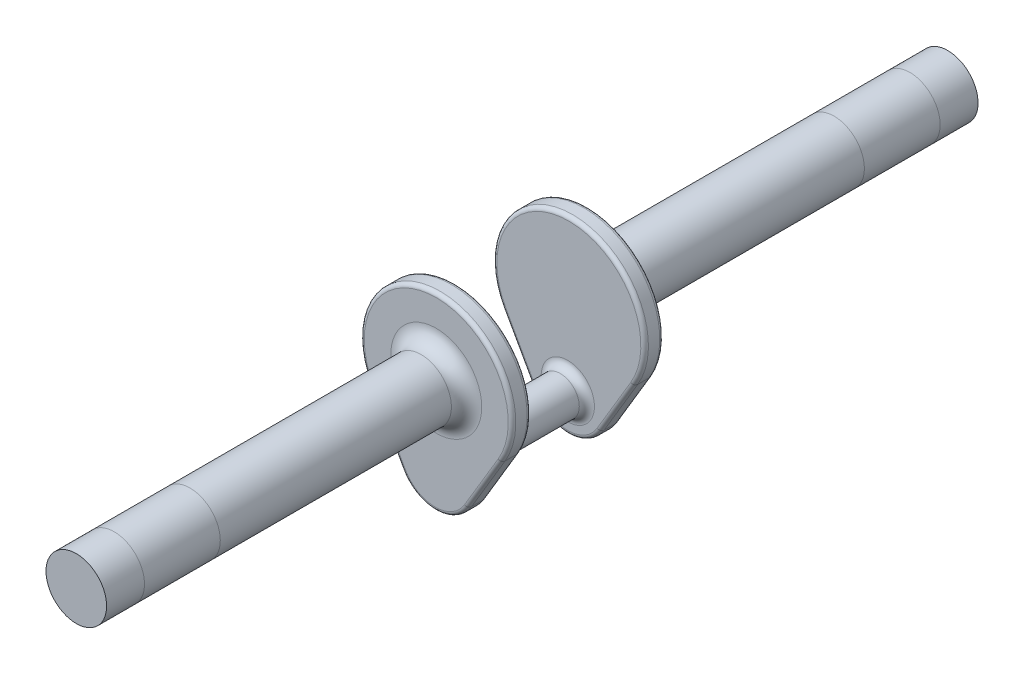
ISO-10303-21;
HEADER;
FILE_DESCRIPTION(('STEP AP214'),'2;1');
FILE_NAME('part.step','',(''),(''),'','','');
FILE_SCHEMA(('AUTOMOTIVE_DESIGN { 1 0 10303 214 1 1 1 1 }'));
ENDSEC;
DATA;
#1=APPLICATION_CONTEXT('core data for automotive mechanical design processes');
#2=APPLICATION_PROTOCOL_DEFINITION('international standard','automotive_design',2000,#1);
#3=PRODUCT_CONTEXT('',#1,'mechanical');
#4=PRODUCT('Part','Part','',(#3));
#5=PRODUCT_RELATED_PRODUCT_CATEGORY('part','',(#4));
#6=PRODUCT_DEFINITION_FORMATION('','',#4);
#7=PRODUCT_DEFINITION_CONTEXT('part definition',#1,'design');
#8=PRODUCT_DEFINITION('design','',#6,#7);
#9=PRODUCT_DEFINITION_SHAPE('','',#8);
#10=(LENGTH_UNIT() NAMED_UNIT(*) SI_UNIT(.MILLI.,.METRE.));
#11=(NAMED_UNIT(*) PLANE_ANGLE_UNIT() SI_UNIT($,.RADIAN.));
#12=(NAMED_UNIT(*) SI_UNIT($,.STERADIAN.) SOLID_ANGLE_UNIT());
#13=UNCERTAINTY_MEASURE_WITH_UNIT(LENGTH_MEASURE(1.E-05),#10,'distance_accuracy_value','');
#14=(GEOMETRIC_REPRESENTATION_CONTEXT(3) GLOBAL_UNCERTAINTY_ASSIGNED_CONTEXT((#13)) GLOBAL_UNIT_ASSIGNED_CONTEXT((#10,
#11,#12)) REPRESENTATION_CONTEXT('',''));
#15=CARTESIAN_POINT('',(0.,0.,0.));
#16=DIRECTION('',(0.,0.,1.));
#17=DIRECTION('',(1.,0.,0.));
#18=AXIS2_PLACEMENT_3D('',#15,#16,#17);
#19=CARTESIAN_POINT('',(0.,0.,-120.65));
#20=DIRECTION('',(0.,0.,1.));
#21=DIRECTION('',(1.,0.,0.));
#22=AXIS2_PLACEMENT_3D('',#19,#20,#21);
#23=CYLINDRICAL_SURFACE('',#22,10.1604447554047);
#24=CARTESIAN_POINT('',(0.,0.,-82.55));
#25=DIRECTION('',(0.,0.,-1.));
#26=DIRECTION('',(-1.,0.,0.));
#27=AXIS2_PLACEMENT_3D('',#24,#25,#26);
#28=CIRCLE('',#27,10.1604447554047);
#29=CARTESIAN_POINT('',(-10.1604447554047,0.,-82.55));
#30=VERTEX_POINT('',#29);
#31=EDGE_CURVE('E48',#30,#30,#28,.T.);
#32=ORIENTED_EDGE('',*,*,#31,.T.);
#33=EDGE_LOOP('',(#32));
#34=FACE_BOUND('',#33,.T.);
#35=CARTESIAN_POINT('',(0.,0.,-107.95));
#36=DIRECTION('',(0.,0.,-1.));
#37=DIRECTION('',(-1.,0.,0.));
#38=AXIS2_PLACEMENT_3D('',#35,#36,#37);
#39=CIRCLE('',#38,10.1604447554047);
#40=CARTESIAN_POINT('',(-10.1604447554047,0.,-107.95));
#41=VERTEX_POINT('',#40);
#42=EDGE_CURVE('E11',#41,#41,#39,.T.);
#43=ORIENTED_EDGE('',*,*,#42,.F.);
#44=EDGE_LOOP('',(#43));
#45=FACE_BOUND('',#44,.T.);
#46=ADVANCED_FACE('F39',(#34,#45),#23,.T.);
#47=CARTESIAN_POINT('',(0.,0.,-5.08));
#48=DIRECTION('',(0.,0.,1.));
#49=DIRECTION('',(1.,0.,0.));
#50=AXIS2_PLACEMENT_3D('',#47,#48,#49);
#51=CIRCLE('',#50,10.1604447554047);
#52=CARTESIAN_POINT('',(10.1604447554047,0.,-5.08));
#53=VERTEX_POINT('',#52);
#54=EDGE_CURVE('E268',#53,#53,#51,.F.);
#55=ORIENTED_EDGE('',*,*,#54,.T.);
#56=EDGE_LOOP('',(#55));
#57=FACE_BOUND('',#56,.T.);
#58=ORIENTED_EDGE('',*,*,#31,.F.);
#59=EDGE_LOOP('',(#58));
#60=FACE_BOUND('',#59,.T.);
#61=ADVANCED_FACE('F332',(#57,#60),#23,.T.);
#62=CARTESIAN_POINT('',(0.,0.,6.35));
#63=DIRECTION('',(0.,0.,1.));
#64=DIRECTION('',(1.,0.,0.));
#65=AXIS2_PLACEMENT_3D('',#62,#63,#64);
#66=PLANE('',#65);
#67=CARTESIAN_POINT('',(-0.358243610927282,-25.4,6.35));
#68=DIRECTION('',(0.,0.,1.));
#69=DIRECTION('',(1.,0.,0.));
#70=AXIS2_PLACEMENT_3D('',#67,#68,#69);
#71=CIRCLE('',#70,11.43);
#72=CARTESIAN_POINT('',(-10.3368464365435,-30.9742609957379,6.35));
#73=VERTEX_POINT('',#72);
#74=CARTESIAN_POINT('',(9.45918165202621,-31.2534657431579,6.35));
#75=VERTEX_POINT('',#74);
#76=EDGE_CURVE('E278',#73,#75,#71,.T.);
#77=ORIENTED_EDGE('',*,*,#76,.T.);
#78=DIRECTION('',(0.51211423824653,0.858917345840201,0.));
#79=VECTOR('',#78,1.);
#80=CARTESIAN_POINT('',(20.7256755551241,-12.3573165688888,6.35));
#81=LINE('',#80,#79);
#82=CARTESIAN_POINT('',(20.7256755551241,-12.3573165688888,6.35));
#83=VERTEX_POINT('',#82);
#84=EDGE_CURVE('E280',#75,#83,#81,.T.);
#85=ORIENTED_EDGE('',*,*,#84,.T.);
#86=CARTESIAN_POINT('',(0.,0.,6.35));
#87=DIRECTION('',(0.,0.,1.));
#88=DIRECTION('',(1.,0.,0.));
#89=AXIS2_PLACEMENT_3D('',#86,#87,#88);
#90=CIRCLE('',#89,24.13);
#91=CARTESIAN_POINT('',(-21.0659392985231,-11.7678843243355,6.35));
#92=VERTEX_POINT('',#91);
#93=EDGE_CURVE('E274',#83,#92,#90,.T.);
#94=ORIENTED_EDGE('',*,*,#93,.T.);
#95=DIRECTION('',(0.487686876267531,-0.873018619913927,0.));
#96=VECTOR('',#95,1.);
#97=CARTESIAN_POINT('',(-10.3368464365435,-30.9742609957379,6.35));
#98=LINE('',#97,#96);
#99=EDGE_CURVE('E276',#92,#73,#98,.T.);
#100=ORIENTED_EDGE('',*,*,#99,.T.);
#101=EDGE_LOOP('',(#77,#85,#94,#100));
#102=FACE_BOUND('',#101,.T.);
#103=CARTESIAN_POINT('',(-0.358243610927282,-25.4,6.35));
#104=DIRECTION('',(0.,0.,1.));
#105=DIRECTION('',(1.,0.,0.));
#106=AXIS2_PLACEMENT_3D('',#103,#104,#105);
#107=CIRCLE('',#106,8.92917244429606);
#108=CARTESIAN_POINT('',(8.57092883336878,-25.4,6.35));
#109=VERTEX_POINT('',#108);
#110=EDGE_CURVE('E265',#109,#109,#107,.F.);
#111=ORIENTED_EDGE('',*,*,#110,.T.);
#112=EDGE_LOOP('',(#111));
#113=FACE_BOUND('',#112,.T.);
#114=ADVANCED_FACE('F334',(#102,#113),#66,.T.);
#115=CARTESIAN_POINT('',(0.,0.,0.));
#116=DIRECTION('',(0.,0.,1.));
#117=DIRECTION('',(1.,0.,0.));
#118=AXIS2_PLACEMENT_3D('',#115,#116,#117);
#119=PLANE('',#118);
#120=CARTESIAN_POINT('',(0.,0.,0.));
#121=DIRECTION('',(0.,0.,1.));
#122=DIRECTION('',(1.,0.,0.));
#123=AXIS2_PLACEMENT_3D('',#120,#121,#122);
#124=CIRCLE('',#123,24.13);
#125=CARTESIAN_POINT('',(-21.0659392985231,-11.7678843243355,0.));
#126=VERTEX_POINT('',#125);
#127=CARTESIAN_POINT('',(20.7256755551241,-12.3573165688888,0.));
#128=VERTEX_POINT('',#127);
#129=EDGE_CURVE('E297',#126,#128,#124,.F.);
#130=ORIENTED_EDGE('',*,*,#129,.T.);
#131=DIRECTION('',(0.51211423824653,0.858917345840201,0.));
#132=VECTOR('',#131,1.);
#133=CARTESIAN_POINT('',(20.7256755551241,-12.3573165688888,0.));
#134=LINE('',#133,#132);
#135=CARTESIAN_POINT('',(9.45918165202621,-31.2534657431579,0.));
#136=VERTEX_POINT('',#135);
#137=EDGE_CURVE('E302',#128,#136,#134,.F.);
#138=ORIENTED_EDGE('',*,*,#137,.T.);
#139=CARTESIAN_POINT('',(-0.358243610927282,-25.4,0.));
#140=DIRECTION('',(0.,0.,1.));
#141=DIRECTION('',(1.,0.,0.));
#142=AXIS2_PLACEMENT_3D('',#139,#140,#141);
#143=CIRCLE('',#142,11.43);
#144=CARTESIAN_POINT('',(-10.3368464365435,-30.9742609957379,0.));
#145=VERTEX_POINT('',#144);
#146=EDGE_CURVE('E62',#136,#145,#143,.F.);
#147=ORIENTED_EDGE('',*,*,#146,.T.);
#148=DIRECTION('',(0.487686876267531,-0.873018619913927,0.));
#149=VECTOR('',#148,1.);
#150=CARTESIAN_POINT('',(-21.0659392985231,-11.7678843243355,0.));
#151=LINE('',#150,#149);
#152=EDGE_CURVE('E299',#145,#126,#151,.F.);
#153=ORIENTED_EDGE('',*,*,#152,.T.);
#154=EDGE_LOOP('',(#130,#138,#147,#153));
#155=FACE_BOUND('',#154,.T.);
#156=CARTESIAN_POINT('',(0.,0.,0.));
#157=DIRECTION('',(0.,0.,1.));
#158=DIRECTION('',(1.,0.,0.));
#159=AXIS2_PLACEMENT_3D('',#156,#157,#158);
#160=CIRCLE('',#159,15.2404447554047);
#161=CARTESIAN_POINT('',(15.2404447554047,0.,0.));
#162=VERTEX_POINT('',#161);
#163=EDGE_CURVE('E271',#162,#162,#160,.T.);
#164=ORIENTED_EDGE('',*,*,#163,.T.);
#165=EDGE_LOOP('',(#164));
#166=FACE_BOUND('',#165,.T.);
#167=ADVANCED_FACE('F342',(#155,#166),#119,.F.);
#168=CARTESIAN_POINT('',(0.,0.,6.35));
#169=DIRECTION('',(0.,0.,-1.));
#170=DIRECTION('',(-1.,0.,0.));
#171=AXIS2_PLACEMENT_3D('',#168,#169,#170);
#172=CYLINDRICAL_SURFACE('',#171,25.4);
#173=DIRECTION('',(0.,0.,-1.));
#174=VECTOR('',#173,1.);
#175=CARTESIAN_POINT('',(-22.1746729458138,-12.3872466571953,6.35));
#176=LINE('',#175,#174);
#177=CARTESIAN_POINT('',(-22.1746729458138,-12.3872466571953,5.08));
#178=VERTEX_POINT('',#177);
#179=CARTESIAN_POINT('',(-22.1746729458138,-12.3872466571953,1.27));
#180=VERTEX_POINT('',#179);
#181=EDGE_CURVE('E259',#178,#180,#176,.T.);
#182=ORIENTED_EDGE('',*,*,#181,.F.);
#183=CARTESIAN_POINT('',(0.,0.,5.08));
#184=DIRECTION('',(0.,0.,1.));
#185=DIRECTION('',(1.,0.,0.));
#186=AXIS2_PLACEMENT_3D('',#183,#184,#185);
#187=CIRCLE('',#186,25.4);
#188=CARTESIAN_POINT('',(21.8165005843411,-13.0077016514619,5.08));
#189=VERTEX_POINT('',#188);
#190=EDGE_CURVE('E306',#178,#189,#187,.F.);
#191=ORIENTED_EDGE('',*,*,#190,.T.);
#192=DIRECTION('',(0.,0.,-1.));
#193=VECTOR('',#192,1.);
#194=CARTESIAN_POINT('',(21.8165005843411,-13.0077016514619,6.35));
#195=LINE('',#194,#193);
#196=CARTESIAN_POINT('',(21.8165005843411,-13.0077016514619,1.27));
#197=VERTEX_POINT('',#196);
#198=EDGE_CURVE('E249',#189,#197,#195,.T.);
#199=ORIENTED_EDGE('',*,*,#198,.T.);
#200=CARTESIAN_POINT('',(0.,0.,1.27));
#201=DIRECTION('',(0.,0.,1.));
#202=DIRECTION('',(1.,0.,0.));
#203=AXIS2_PLACEMENT_3D('',#200,#201,#202);
#204=CIRCLE('',#203,25.4);
#205=EDGE_CURVE('E304',#197,#180,#204,.T.);
#206=ORIENTED_EDGE('',*,*,#205,.T.);
#207=EDGE_LOOP('',(#182,#191,#199,#206));
#208=FACE_BOUND('',#207,.T.);
#209=ADVANCED_FACE('F373',(#208),#172,.T.);
#210=CARTESIAN_POINT('',(-22.1746729458138,-12.3872466571953,6.35));
#211=DIRECTION('',(0.873018619913927,0.487686876267531,0.));
#212=DIRECTION('',(-0.487686876267531,0.873018619913927,0.));
#213=AXIS2_PLACEMENT_3D('',#210,#211,#212);
#214=PLANE('',#213);
#215=DIRECTION('',(0.,0.,-1.));
#216=VECTOR('',#215,1.);
#217=CARTESIAN_POINT('',(-11.4455800838342,-31.5936233285976,6.35));
#218=LINE('',#217,#216);
#219=CARTESIAN_POINT('',(-11.4455800838342,-31.5936233285976,5.08));
#220=VERTEX_POINT('',#219);
#221=CARTESIAN_POINT('',(-11.4455800838342,-31.5936233285976,1.27));
#222=VERTEX_POINT('',#221);
#223=EDGE_CURVE('E256',#220,#222,#218,.T.);
#224=ORIENTED_EDGE('',*,*,#223,.F.);
#225=DIRECTION('',(0.487686876267531,-0.873018619913927,0.));
#226=VECTOR('',#225,1.);
#227=CARTESIAN_POINT('',(-22.1746729458138,-12.3872466571953,5.08));
#228=LINE('',#227,#226);
#229=EDGE_CURVE('E295',#220,#178,#228,.F.);
#230=ORIENTED_EDGE('',*,*,#229,.T.);
#231=ORIENTED_EDGE('',*,*,#181,.T.);
#232=DIRECTION('',(0.487686876267531,-0.873018619913927,0.));
#233=VECTOR('',#232,1.);
#234=CARTESIAN_POINT('',(-22.1746729458138,-12.3872466571953,1.27));
#235=LINE('',#234,#233);
#236=EDGE_CURVE('E293',#180,#222,#235,.T.);
#237=ORIENTED_EDGE('',*,*,#236,.T.);
#238=EDGE_LOOP('',(#224,#230,#231,#237));
#239=FACE_BOUND('',#238,.T.);
#240=ADVANCED_FACE('F365',(#239),#214,.F.);
#241=CARTESIAN_POINT('',(-0.358243610927282,-25.4,6.35));
#242=DIRECTION('',(0.,0.,-1.));
#243=DIRECTION('',(-1.,0.,0.));
#244=AXIS2_PLACEMENT_3D('',#241,#242,#243);
#245=CYLINDRICAL_SURFACE('',#244,12.7);
#246=DIRECTION('',(0.,0.,-1.));
#247=VECTOR('',#246,1.);
#248=CARTESIAN_POINT('',(10.5500066812433,-31.9038508257309,6.35));
#249=LINE('',#248,#247);
#250=CARTESIAN_POINT('',(10.5500066812433,-31.9038508257309,5.08));
#251=VERTEX_POINT('',#250);
#252=CARTESIAN_POINT('',(10.5500066812433,-31.9038508257309,1.27));
#253=VERTEX_POINT('',#252);
#254=EDGE_CURVE('E253',#251,#253,#249,.T.);
#255=ORIENTED_EDGE('',*,*,#254,.F.);
#256=CARTESIAN_POINT('',(-0.358243610927282,-25.4,5.08));
#257=DIRECTION('',(0.,0.,1.));
#258=DIRECTION('',(1.,0.,0.));
#259=AXIS2_PLACEMENT_3D('',#256,#257,#258);
#260=CIRCLE('',#259,12.7);
#261=EDGE_CURVE('E291',#251,#220,#260,.F.);
#262=ORIENTED_EDGE('',*,*,#261,.T.);
#263=ORIENTED_EDGE('',*,*,#223,.T.);
#264=CARTESIAN_POINT('',(-0.358243610927282,-25.4,1.27));
#265=DIRECTION('',(0.,0.,1.));
#266=DIRECTION('',(1.,0.,0.));
#267=AXIS2_PLACEMENT_3D('',#264,#265,#266);
#268=CIRCLE('',#267,12.7);
#269=EDGE_CURVE('E289',#222,#253,#268,.T.);
#270=ORIENTED_EDGE('',*,*,#269,.T.);
#271=EDGE_LOOP('',(#255,#262,#263,#270));
#272=FACE_BOUND('',#271,.T.);
#273=ADVANCED_FACE('F356',(#272),#245,.T.);
#274=CARTESIAN_POINT('',(21.8165005843411,-13.0077016514619,6.35));
#275=DIRECTION('',(-0.858917345840201,0.51211423824653,0.));
#276=DIRECTION('',(-0.51211423824653,-0.858917345840201,0.));
#277=AXIS2_PLACEMENT_3D('',#274,#275,#276);
#278=PLANE('',#277);
#279=ORIENTED_EDGE('',*,*,#198,.F.);
#280=DIRECTION('',(0.51211423824653,0.858917345840201,0.));
#281=VECTOR('',#280,1.);
#282=CARTESIAN_POINT('',(10.5500066812433,-31.9038508257309,5.08));
#283=LINE('',#282,#281);
#284=EDGE_CURVE('E286',#189,#251,#283,.F.);
#285=ORIENTED_EDGE('',*,*,#284,.T.);
#286=ORIENTED_EDGE('',*,*,#254,.T.);
#287=DIRECTION('',(0.51211423824653,0.858917345840201,0.));
#288=VECTOR('',#287,1.);
#289=CARTESIAN_POINT('',(21.8165005843411,-13.0077016514619,1.27));
#290=LINE('',#289,#288);
#291=EDGE_CURVE('E283',#253,#197,#290,.T.);
#292=ORIENTED_EDGE('',*,*,#291,.T.);
#293=EDGE_LOOP('',(#279,#285,#286,#292));
#294=FACE_BOUND('',#293,.T.);
#295=ADVANCED_FACE('F348',(#294),#278,.F.);
#296=ORIENTED_EDGE('',*,*,#42,.T.);
#297=EDGE_LOOP('',(#296));
#298=FACE_BOUND('',#297,.T.);
#299=CARTESIAN_POINT('',(0.,0.,-120.65));
#300=DIRECTION('',(0.,0.,-1.));
#301=DIRECTION('',(-1.,0.,0.));
#302=AXIS2_PLACEMENT_3D('',#299,#300,#301);
#303=CIRCLE('',#302,10.1604447554047);
#304=CARTESIAN_POINT('',(-10.1604447554047,0.,-120.65));
#305=VERTEX_POINT('',#304);
#306=EDGE_CURVE('E246',#305,#305,#303,.T.);
#307=ORIENTED_EDGE('',*,*,#306,.F.);
#308=EDGE_LOOP('',(#307));
#309=FACE_BOUND('',#308,.T.);
#310=ADVANCED_FACE('F337',(#298,#309),#23,.T.);
#311=CARTESIAN_POINT('',(0.,0.,-120.65));
#312=DIRECTION('',(0.,0.,-1.));
#313=DIRECTION('',(-1.,0.,0.));
#314=AXIS2_PLACEMENT_3D('',#311,#312,#313);
#315=PLANE('',#314);
#316=ORIENTED_EDGE('',*,*,#306,.T.);
#317=EDGE_LOOP('',(#316));
#318=FACE_BOUND('',#317,.T.);
#319=ADVANCED_FACE('F347',(#318),#315,.T.);
#320=CARTESIAN_POINT('',(-0.358243610927282,-25.4,25.4));
#321=DIRECTION('',(0.,0.,-1.));
#322=DIRECTION('',(-1.,0.,0.));
#323=AXIS2_PLACEMENT_3D('',#320,#321,#322);
#324=CYLINDRICAL_SURFACE('',#323,6.38917244429606);
#325=CARTESIAN_POINT('',(-0.358243610927282,-25.4,8.89));
#326=DIRECTION('',(0.,0.,1.));
#327=DIRECTION('',(1.,0.,0.));
#328=AXIS2_PLACEMENT_3D('',#325,#326,#327);
#329=CIRCLE('',#328,6.38917244429606);
#330=CARTESIAN_POINT('',(6.03092883336878,-25.4,8.89));
#331=VERTEX_POINT('',#330);
#332=EDGE_CURVE('E262',#331,#331,#329,.T.);
#333=ORIENTED_EDGE('',*,*,#332,.T.);
#334=EDGE_LOOP('',(#333));
#335=FACE_BOUND('',#334,.T.);
#336=CARTESIAN_POINT('',(-0.358243610927282,-25.4,41.91));
#337=DIRECTION('',(0.,0.,1.));
#338=DIRECTION('',(1.,0.,0.));
#339=AXIS2_PLACEMENT_3D('',#336,#337,#338);
#340=CIRCLE('',#339,6.38917244429606);
#341=CARTESIAN_POINT('',(6.03092883336878,-25.4,41.91));
#342=VERTEX_POINT('',#341);
#343=EDGE_CURVE('E449',#342,#342,#340,.T.);
#344=ORIENTED_EDGE('',*,*,#343,.F.);
#345=EDGE_LOOP('',(#344));
#346=FACE_BOUND('',#345,.T.);
#347=ADVANCED_FACE('F354',(#335,#346),#324,.T.);
#348=CARTESIAN_POINT('',(-0.358243610927282,-25.4,8.89));
#349=DIRECTION('',(0.,0.,1.));
#350=DIRECTION('',(1.,0.,0.));
#351=AXIS2_PLACEMENT_3D('',#348,#349,#350);
#352=TOROIDAL_SURFACE('',#351,8.92917244429606,2.54);
#353=ORIENTED_EDGE('',*,*,#110,.F.);
#354=EDGE_LOOP('',(#353));
#355=FACE_BOUND('',#354,.T.);
#356=ORIENTED_EDGE('',*,*,#332,.F.);
#357=EDGE_LOOP('',(#356));
#358=FACE_BOUND('',#357,.T.);
#359=ADVANCED_FACE('F378',(#355,#358),#352,.F.);
#360=CARTESIAN_POINT('',(0.,0.,-5.08));
#361=DIRECTION('',(0.,0.,1.));
#362=DIRECTION('',(1.,0.,0.));
#363=AXIS2_PLACEMENT_3D('',#360,#361,#362);
#364=TOROIDAL_SURFACE('',#363,15.2404447554047,5.08);
#365=ORIENTED_EDGE('',*,*,#163,.F.);
#366=EDGE_LOOP('',(#365));
#367=FACE_BOUND('',#366,.T.);
#368=ORIENTED_EDGE('',*,*,#54,.F.);
#369=EDGE_LOOP('',(#368));
#370=FACE_BOUND('',#369,.T.);
#371=ADVANCED_FACE('F381',(#367,#370),#364,.F.);
#372=CARTESIAN_POINT('',(-21.0659392985231,-11.7678843243355,5.08));
#373=DIRECTION('',(-0.487686876267531,0.873018619913927,0.));
#374=DIRECTION('',(-0.873018619913927,-0.487686876267531,0.));
#375=AXIS2_PLACEMENT_3D('',#372,#373,#374);
#376=CYLINDRICAL_SURFACE('',#375,1.27);
#377=CARTESIAN_POINT('',(-21.0659392985231,-11.7678843243355,5.08));
#378=DIRECTION('',(-0.487686876267531,0.873018619913927,0.));
#379=DIRECTION('',(-0.873018619913927,-0.487686876267531,0.));
#380=AXIS2_PLACEMENT_3D('',#377,#378,#379);
#381=CIRCLE('',#380,1.27);
#382=EDGE_CURVE('E313',#178,#92,#381,.T.);
#383=ORIENTED_EDGE('',*,*,#382,.F.);
#384=ORIENTED_EDGE('',*,*,#229,.F.);
#385=CARTESIAN_POINT('',(-10.3368464365435,-30.9742609957379,5.08));
#386=DIRECTION('',(0.487686876267529,-0.873018619913928,0.));
#387=DIRECTION('',(0.873018619913928,0.487686876267529,0.));
#388=AXIS2_PLACEMENT_3D('',#385,#386,#387);
#389=CIRCLE('',#388,1.27);
#390=EDGE_CURVE('E250',#73,#220,#389,.T.);
#391=ORIENTED_EDGE('',*,*,#390,.F.);
#392=ORIENTED_EDGE('',*,*,#99,.F.);
#393=EDGE_LOOP('',(#383,#384,#391,#392));
#394=FACE_BOUND('',#393,.T.);
#395=ADVANCED_FACE('F385',(#394),#376,.T.);
#396=CARTESIAN_POINT('',(-0.358243610927282,-25.4,5.08));
#397=DIRECTION('',(0.,0.,1.));
#398=DIRECTION('',(1.,0.,0.));
#399=AXIS2_PLACEMENT_3D('',#396,#397,#398);
#400=TOROIDAL_SURFACE('',#399,11.43,1.27);
#401=ORIENTED_EDGE('',*,*,#390,.T.);
#402=ORIENTED_EDGE('',*,*,#261,.F.);
#403=CARTESIAN_POINT('',(9.45918165202621,-31.2534657431579,5.08));
#404=DIRECTION('',(0.512114238246528,0.858917345840203,0.));
#405=DIRECTION('',(-0.858917345840203,0.512114238246528,0.));
#406=AXIS2_PLACEMENT_3D('',#403,#404,#405);
#407=CIRCLE('',#406,1.27);
#408=EDGE_CURVE('E310',#75,#251,#407,.T.);
#409=ORIENTED_EDGE('',*,*,#408,.F.);
#410=ORIENTED_EDGE('',*,*,#76,.F.);
#411=EDGE_LOOP('',(#401,#402,#409,#410));
#412=FACE_BOUND('',#411,.T.);
#413=ADVANCED_FACE('F394',(#412),#400,.T.);
#414=CARTESIAN_POINT('',(0.,0.,5.08));
#415=DIRECTION('',(0.,0.,1.));
#416=DIRECTION('',(1.,0.,0.));
#417=AXIS2_PLACEMENT_3D('',#414,#415,#416);
#418=TOROIDAL_SURFACE('',#417,24.13,1.27);
#419=ORIENTED_EDGE('',*,*,#382,.T.);
#420=ORIENTED_EDGE('',*,*,#93,.F.);
#421=CARTESIAN_POINT('',(20.7256755551241,-12.3573165688888,5.08));
#422=DIRECTION('',(-0.512114238246531,-0.858917345840201,0.));
#423=DIRECTION('',(0.858917345840201,-0.512114238246531,0.));
#424=AXIS2_PLACEMENT_3D('',#421,#422,#423);
#425=CIRCLE('',#424,1.27);
#426=EDGE_CURVE('E308',#189,#83,#425,.T.);
#427=ORIENTED_EDGE('',*,*,#426,.F.);
#428=ORIENTED_EDGE('',*,*,#190,.F.);
#429=EDGE_LOOP('',(#419,#420,#427,#428));
#430=FACE_BOUND('',#429,.T.);
#431=ADVANCED_FACE('F390',(#430),#418,.T.);
#432=CARTESIAN_POINT('',(20.7256755551241,-12.3573165688888,5.08));
#433=DIRECTION('',(-0.51211423824653,-0.858917345840201,0.));
#434=DIRECTION('',(0.858917345840201,-0.51211423824653,0.));
#435=AXIS2_PLACEMENT_3D('',#432,#433,#434);
#436=CYLINDRICAL_SURFACE('',#435,1.27);
#437=ORIENTED_EDGE('',*,*,#408,.T.);
#438=ORIENTED_EDGE('',*,*,#284,.F.);
#439=ORIENTED_EDGE('',*,*,#426,.T.);
#440=ORIENTED_EDGE('',*,*,#84,.F.);
#441=EDGE_LOOP('',(#437,#438,#439,#440));
#442=FACE_BOUND('',#441,.T.);
#443=ADVANCED_FACE('F387',(#442),#436,.T.);
#444=CARTESIAN_POINT('',(-21.0659392985231,-11.7678843243355,1.27));
#445=DIRECTION('',(0.487686876267531,-0.873018619913927,0.));
#446=DIRECTION('',(0.873018619913927,0.487686876267531,0.));
#447=AXIS2_PLACEMENT_3D('',#444,#445,#446);
#448=CYLINDRICAL_SURFACE('',#447,1.27);
#449=CARTESIAN_POINT('',(-21.0659392985231,-11.7678843243355,1.27));
#450=DIRECTION('',(-0.487686876267531,0.873018619913927,0.));
#451=DIRECTION('',(-0.873018619913927,-0.487686876267531,0.));
#452=AXIS2_PLACEMENT_3D('',#449,#450,#451);
#453=CIRCLE('',#452,1.27);
#454=EDGE_CURVE('E320',#126,#180,#453,.T.);
#455=ORIENTED_EDGE('',*,*,#454,.F.);
#456=ORIENTED_EDGE('',*,*,#152,.F.);
#457=CARTESIAN_POINT('',(-10.3368464365435,-30.9742609957379,1.27));
#458=DIRECTION('',(0.487686876267532,-0.873018619913926,0.));
#459=DIRECTION('',(0.873018619913927,0.487686876267532,0.));
#460=AXIS2_PLACEMENT_3D('',#457,#458,#459);
#461=CIRCLE('',#460,1.27);
#462=EDGE_CURVE('E311',#222,#145,#461,.T.);
#463=ORIENTED_EDGE('',*,*,#462,.F.);
#464=ORIENTED_EDGE('',*,*,#236,.F.);
#465=EDGE_LOOP('',(#455,#456,#463,#464));
#466=FACE_BOUND('',#465,.T.);
#467=ADVANCED_FACE('F41',(#466),#448,.T.);
#468=CARTESIAN_POINT('',(-0.358243610927282,-25.4,1.27));
#469=DIRECTION('',(0.,0.,1.));
#470=DIRECTION('',(1.,0.,0.));
#471=AXIS2_PLACEMENT_3D('',#468,#469,#470);
#472=TOROIDAL_SURFACE('',#471,11.43,1.27);
#473=ORIENTED_EDGE('',*,*,#462,.T.);
#474=ORIENTED_EDGE('',*,*,#146,.F.);
#475=CARTESIAN_POINT('',(9.45918165202622,-31.2534657431578,1.27));
#476=DIRECTION('',(0.512114238246533,0.8589173458402,0.));
#477=DIRECTION('',(-0.8589173458402,0.512114238246533,0.));
#478=AXIS2_PLACEMENT_3D('',#475,#476,#477);
#479=CIRCLE('',#478,1.27);
#480=EDGE_CURVE('E55',#253,#136,#479,.T.);
#481=ORIENTED_EDGE('',*,*,#480,.F.);
#482=ORIENTED_EDGE('',*,*,#269,.F.);
#483=EDGE_LOOP('',(#473,#474,#481,#482));
#484=FACE_BOUND('',#483,.T.);
#485=ADVANCED_FACE('F408',(#484),#472,.T.);
#486=CARTESIAN_POINT('',(0.,0.,1.27));
#487=DIRECTION('',(0.,0.,1.));
#488=DIRECTION('',(1.,0.,0.));
#489=AXIS2_PLACEMENT_3D('',#486,#487,#488);
#490=TOROIDAL_SURFACE('',#489,24.13,1.27);
#491=ORIENTED_EDGE('',*,*,#454,.T.);
#492=ORIENTED_EDGE('',*,*,#205,.F.);
#493=CARTESIAN_POINT('',(20.7256755551241,-12.3573165688888,1.27));
#494=DIRECTION('',(-0.512114238246531,-0.858917345840201,0.));
#495=DIRECTION('',(0.858917345840201,-0.512114238246531,0.));
#496=AXIS2_PLACEMENT_3D('',#493,#494,#495);
#497=CIRCLE('',#496,1.27);
#498=EDGE_CURVE('E245',#128,#197,#497,.T.);
#499=ORIENTED_EDGE('',*,*,#498,.F.);
#500=ORIENTED_EDGE('',*,*,#129,.F.);
#501=EDGE_LOOP('',(#491,#492,#499,#500));
#502=FACE_BOUND('',#501,.T.);
#503=ADVANCED_FACE('F406',(#502),#490,.T.);
#504=CARTESIAN_POINT('',(20.7256755551241,-12.3573165688888,1.27));
#505=DIRECTION('',(0.51211423824653,0.858917345840201,0.));
#506=DIRECTION('',(-0.858917345840201,0.51211423824653,0.));
#507=AXIS2_PLACEMENT_3D('',#504,#505,#506);
#508=CYLINDRICAL_SURFACE('',#507,1.27);
#509=ORIENTED_EDGE('',*,*,#480,.T.);
#510=ORIENTED_EDGE('',*,*,#137,.F.);
#511=ORIENTED_EDGE('',*,*,#498,.T.);
#512=ORIENTED_EDGE('',*,*,#291,.F.);
#513=EDGE_LOOP('',(#509,#510,#511,#512));
#514=FACE_BOUND('',#513,.T.);
#515=ADVANCED_FACE('F402',(#514),#508,.T.);
#516=CARTESIAN_POINT('',(0.,0.,171.45));
#517=DIRECTION('',(0.,0.,-1.));
#518=DIRECTION('',(1.,0.,0.));
#519=AXIS2_PLACEMENT_3D('',#516,#517,#518);
#520=CYLINDRICAL_SURFACE('',#519,10.1604447554047);
#521=CARTESIAN_POINT('',(0.,0.,133.35));
#522=DIRECTION('',(0.,0.,-1.));
#523=DIRECTION('',(-1.,0.,0.));
#524=AXIS2_PLACEMENT_3D('',#521,#522,#523);
#525=CIRCLE('',#524,10.1604447554047);
#526=CARTESIAN_POINT('',(-10.1604447554047,0.,133.35));
#527=VERTEX_POINT('',#526);
#528=EDGE_CURVE('E223',#527,#527,#525,.T.);
#529=ORIENTED_EDGE('',*,*,#528,.F.);
#530=EDGE_LOOP('',(#529));
#531=FACE_BOUND('',#530,.T.);
#532=CARTESIAN_POINT('',(0.,0.,158.75));
#533=DIRECTION('',(0.,0.,-1.));
#534=DIRECTION('',(-1.,0.,0.));
#535=AXIS2_PLACEMENT_3D('',#532,#533,#534);
#536=CIRCLE('',#535,10.1604447554047);
#537=CARTESIAN_POINT('',(-10.1604447554047,0.,158.75));
#538=VERTEX_POINT('',#537);
#539=EDGE_CURVE('E241',#538,#538,#536,.T.);
#540=ORIENTED_EDGE('',*,*,#539,.T.);
#541=EDGE_LOOP('',(#540));
#542=FACE_BOUND('',#541,.T.);
#543=ADVANCED_FACE('F405',(#531,#542),#520,.T.);
#544=CARTESIAN_POINT('',(0.,0.,55.88));
#545=DIRECTION('',(0.,0.,1.));
#546=DIRECTION('',(1.,0.,0.));
#547=AXIS2_PLACEMENT_3D('',#544,#545,#546);
#548=CIRCLE('',#547,10.1604447554047);
#549=CARTESIAN_POINT('',(10.1604447554047,0.,55.88));
#550=VERTEX_POINT('',#549);
#551=EDGE_CURVE('E187',#550,#550,#548,.F.);
#552=ORIENTED_EDGE('',*,*,#551,.F.);
#553=EDGE_LOOP('',(#552));
#554=FACE_BOUND('',#553,.T.);
#555=ORIENTED_EDGE('',*,*,#528,.T.);
#556=EDGE_LOOP('',(#555));
#557=FACE_BOUND('',#556,.T.);
#558=ADVANCED_FACE('F465',(#554,#557),#520,.T.);
#559=CARTESIAN_POINT('',(0.,0.,44.45));
#560=DIRECTION('',(0.,0.,-1.));
#561=DIRECTION('',(1.,0.,0.));
#562=AXIS2_PLACEMENT_3D('',#559,#560,#561);
#563=PLANE('',#562);
#564=CARTESIAN_POINT('',(-0.358243610927282,-25.4,44.45));
#565=DIRECTION('',(0.,0.,1.));
#566=DIRECTION('',(1.,0.,0.));
#567=AXIS2_PLACEMENT_3D('',#564,#565,#566);
#568=CIRCLE('',#567,11.43);
#569=CARTESIAN_POINT('',(-10.3368464365435,-30.9742609957379,44.45));
#570=VERTEX_POINT('',#569);
#571=CARTESIAN_POINT('',(9.45918165202621,-31.2534657431579,44.45));
#572=VERTEX_POINT('',#571);
#573=EDGE_CURVE('E177',#570,#572,#568,.T.);
#574=ORIENTED_EDGE('',*,*,#573,.F.);
#575=DIRECTION('',(0.487686876267531,-0.873018619913927,0.));
#576=VECTOR('',#575,1.);
#577=CARTESIAN_POINT('',(-10.3368464365435,-30.9742609957379,44.45));
#578=LINE('',#577,#576);
#579=CARTESIAN_POINT('',(-21.0659392985231,-11.7678843243355,44.45));
#580=VERTEX_POINT('',#579);
#581=EDGE_CURVE('E182',#580,#570,#578,.T.);
#582=ORIENTED_EDGE('',*,*,#581,.F.);
#583=CARTESIAN_POINT('',(0.,0.,44.45));
#584=DIRECTION('',(0.,0.,1.));
#585=DIRECTION('',(1.,0.,0.));
#586=AXIS2_PLACEMENT_3D('',#583,#584,#585);
#587=CIRCLE('',#586,24.13);
#588=CARTESIAN_POINT('',(20.7256755551241,-12.3573165688888,44.45));
#589=VERTEX_POINT('',#588);
#590=EDGE_CURVE('E159',#589,#580,#587,.T.);
#591=ORIENTED_EDGE('',*,*,#590,.F.);
#592=DIRECTION('',(0.51211423824653,0.858917345840201,0.));
#593=VECTOR('',#592,1.);
#594=CARTESIAN_POINT('',(20.7256755551241,-12.3573165688888,44.45));
#595=LINE('',#594,#593);
#596=EDGE_CURVE('E171',#572,#589,#595,.T.);
#597=ORIENTED_EDGE('',*,*,#596,.F.);
#598=EDGE_LOOP('',(#574,#582,#591,#597));
#599=FACE_BOUND('',#598,.T.);
#600=CARTESIAN_POINT('',(-0.358243610927282,-25.4,44.45));
#601=DIRECTION('',(0.,0.,1.));
#602=DIRECTION('',(1.,0.,0.));
#603=AXIS2_PLACEMENT_3D('',#600,#601,#602);
#604=CIRCLE('',#603,8.92917244429606);
#605=CARTESIAN_POINT('',(8.57092883336878,-25.4,44.45));
#606=VERTEX_POINT('',#605);
#607=EDGE_CURVE('E451',#606,#606,#604,.F.);
#608=ORIENTED_EDGE('',*,*,#607,.F.);
#609=EDGE_LOOP('',(#608));
#610=FACE_BOUND('',#609,.T.);
#611=ADVANCED_FACE('F179',(#599,#610),#563,.T.);
#612=CARTESIAN_POINT('',(0.,0.,50.8));
#613=DIRECTION('',(0.,0.,-1.));
#614=DIRECTION('',(1.,0.,0.));
#615=AXIS2_PLACEMENT_3D('',#612,#613,#614);
#616=PLANE('',#615);
#617=CARTESIAN_POINT('',(0.,0.,50.8));
#618=DIRECTION('',(0.,0.,1.));
#619=DIRECTION('',(1.,0.,0.));
#620=AXIS2_PLACEMENT_3D('',#617,#618,#619);
#621=CIRCLE('',#620,24.13);
#622=CARTESIAN_POINT('',(-21.0659392985231,-11.7678843243355,50.8));
#623=VERTEX_POINT('',#622);
#624=CARTESIAN_POINT('',(20.7256755551241,-12.3573165688888,50.8));
#625=VERTEX_POINT('',#624);
#626=EDGE_CURVE('E208',#623,#625,#621,.F.);
#627=ORIENTED_EDGE('',*,*,#626,.F.);
#628=DIRECTION('',(0.487686876267531,-0.873018619913927,0.));
#629=VECTOR('',#628,1.);
#630=CARTESIAN_POINT('',(-21.0659392985231,-11.7678843243355,50.8));
#631=LINE('',#630,#629);
#632=CARTESIAN_POINT('',(-10.3368464365435,-30.9742609957379,50.8));
#633=VERTEX_POINT('',#632);
#634=EDGE_CURVE('E211',#633,#623,#631,.F.);
#635=ORIENTED_EDGE('',*,*,#634,.F.);
#636=CARTESIAN_POINT('',(-0.358243610927282,-25.4,50.8));
#637=DIRECTION('',(0.,0.,1.));
#638=DIRECTION('',(1.,0.,0.));
#639=AXIS2_PLACEMENT_3D('',#636,#637,#638);
#640=CIRCLE('',#639,11.43);
#641=CARTESIAN_POINT('',(9.45918165202621,-31.2534657431579,50.8));
#642=VERTEX_POINT('',#641);
#643=EDGE_CURVE('E214',#642,#633,#640,.F.);
#644=ORIENTED_EDGE('',*,*,#643,.F.);
#645=DIRECTION('',(0.51211423824653,0.858917345840201,0.));
#646=VECTOR('',#645,1.);
#647=CARTESIAN_POINT('',(20.7256755551241,-12.3573165688888,50.8));
#648=LINE('',#647,#646);
#649=EDGE_CURVE('E217',#625,#642,#648,.F.);
#650=ORIENTED_EDGE('',*,*,#649,.F.);
#651=EDGE_LOOP('',(#627,#635,#644,#650));
#652=FACE_BOUND('',#651,.T.);
#653=CARTESIAN_POINT('',(0.,0.,50.8));
#654=DIRECTION('',(0.,0.,1.));
#655=DIRECTION('',(1.,0.,0.));
#656=AXIS2_PLACEMENT_3D('',#653,#654,#655);
#657=CIRCLE('',#656,15.2404447554047);
#658=CARTESIAN_POINT('',(15.2404447554047,0.,50.8));
#659=VERTEX_POINT('',#658);
#660=EDGE_CURVE('E183',#659,#659,#657,.T.);
#661=ORIENTED_EDGE('',*,*,#660,.F.);
#662=EDGE_LOOP('',(#661));
#663=FACE_BOUND('',#662,.T.);
#664=ADVANCED_FACE('F520',(#652,#663),#616,.F.);
#665=CARTESIAN_POINT('',(0.,0.,44.45));
#666=DIRECTION('',(0.,0.,1.));
#667=DIRECTION('',(-1.,0.,0.));
#668=AXIS2_PLACEMENT_3D('',#665,#666,#667);
#669=CYLINDRICAL_SURFACE('',#668,25.4);
#670=DIRECTION('',(0.,0.,1.));
#671=VECTOR('',#670,1.);
#672=CARTESIAN_POINT('',(-22.1746729458138,-12.3872466571953,44.45));
#673=LINE('',#672,#671);
#674=CARTESIAN_POINT('',(-22.1746729458138,-12.3872466571953,45.72));
#675=VERTEX_POINT('',#674);
#676=CARTESIAN_POINT('',(-22.1746729458138,-12.3872466571953,49.53));
#677=VERTEX_POINT('',#676);
#678=EDGE_CURVE('E452',#675,#677,#673,.T.);
#679=ORIENTED_EDGE('',*,*,#678,.T.);
#680=CARTESIAN_POINT('',(0.,0.,49.53));
#681=DIRECTION('',(0.,0.,1.));
#682=DIRECTION('',(1.,0.,0.));
#683=AXIS2_PLACEMENT_3D('',#680,#681,#682);
#684=CIRCLE('',#683,25.4);
#685=CARTESIAN_POINT('',(21.8165005843411,-13.0077016514619,49.53));
#686=VERTEX_POINT('',#685);
#687=EDGE_CURVE('E220',#686,#677,#684,.T.);
#688=ORIENTED_EDGE('',*,*,#687,.F.);
#689=DIRECTION('',(0.,0.,1.));
#690=VECTOR('',#689,1.);
#691=CARTESIAN_POINT('',(21.8165005843411,-13.0077016514619,44.45));
#692=LINE('',#691,#690);
#693=CARTESIAN_POINT('',(21.8165005843411,-13.0077016514619,45.72));
#694=VERTEX_POINT('',#693);
#695=EDGE_CURVE('E483',#694,#686,#692,.T.);
#696=ORIENTED_EDGE('',*,*,#695,.F.);
#697=CARTESIAN_POINT('',(0.,0.,45.72));
#698=DIRECTION('',(0.,0.,1.));
#699=DIRECTION('',(1.,0.,0.));
#700=AXIS2_PLACEMENT_3D('',#697,#698,#699);
#701=CIRCLE('',#700,25.4);
#702=EDGE_CURVE('E162',#675,#694,#701,.F.);
#703=ORIENTED_EDGE('',*,*,#702,.F.);
#704=EDGE_LOOP('',(#679,#688,#696,#703));
#705=FACE_BOUND('',#704,.T.);
#706=ADVANCED_FACE('F511',(#705),#669,.T.);
#707=CARTESIAN_POINT('',(-22.1746729458138,-12.3872466571953,44.45));
#708=DIRECTION('',(0.873018619913927,0.487686876267531,0.));
#709=DIRECTION('',(-0.487686876267531,0.873018619913927,0.));
#710=AXIS2_PLACEMENT_3D('',#707,#708,#709);
#711=PLANE('',#710);
#712=DIRECTION('',(0.,0.,1.));
#713=VECTOR('',#712,1.);
#714=CARTESIAN_POINT('',(-11.4455800838342,-31.5936233285976,44.45));
#715=LINE('',#714,#713);
#716=CARTESIAN_POINT('',(-11.4455800838342,-31.5936233285976,45.72));
#717=VERTEX_POINT('',#716);
#718=CARTESIAN_POINT('',(-11.4455800838342,-31.5936233285976,49.53));
#719=VERTEX_POINT('',#718);
#720=EDGE_CURVE('E457',#717,#719,#715,.T.);
#721=ORIENTED_EDGE('',*,*,#720,.T.);
#722=DIRECTION('',(0.487686876267531,-0.873018619913927,0.));
#723=VECTOR('',#722,1.);
#724=CARTESIAN_POINT('',(-22.1746729458138,-12.3872466571953,49.53));
#725=LINE('',#724,#723);
#726=EDGE_CURVE('E202',#677,#719,#725,.T.);
#727=ORIENTED_EDGE('',*,*,#726,.F.);
#728=ORIENTED_EDGE('',*,*,#678,.F.);
#729=DIRECTION('',(0.487686876267531,-0.873018619913927,0.));
#730=VECTOR('',#729,1.);
#731=CARTESIAN_POINT('',(-22.1746729458138,-12.3872466571953,45.72));
#732=LINE('',#731,#730);
#733=EDGE_CURVE('E205',#717,#675,#732,.F.);
#734=ORIENTED_EDGE('',*,*,#733,.F.);
#735=EDGE_LOOP('',(#721,#727,#728,#734));
#736=FACE_BOUND('',#735,.T.);
#737=ADVANCED_FACE('F495',(#736),#711,.F.);
#738=CARTESIAN_POINT('',(-0.358243610927282,-25.4,44.45));
#739=DIRECTION('',(0.,0.,1.));
#740=DIRECTION('',(-1.,0.,0.));
#741=AXIS2_PLACEMENT_3D('',#738,#739,#740);
#742=CYLINDRICAL_SURFACE('',#741,12.7);
#743=DIRECTION('',(0.,0.,1.));
#744=VECTOR('',#743,1.);
#745=CARTESIAN_POINT('',(10.5500066812433,-31.9038508257309,44.45));
#746=LINE('',#745,#744);
#747=CARTESIAN_POINT('',(10.5500066812433,-31.9038508257309,45.72));
#748=VERTEX_POINT('',#747);
#749=CARTESIAN_POINT('',(10.5500066812433,-31.9038508257309,49.53));
#750=VERTEX_POINT('',#749);
#751=EDGE_CURVE('E486',#748,#750,#746,.T.);
#752=ORIENTED_EDGE('',*,*,#751,.T.);
#753=CARTESIAN_POINT('',(-0.358243610927282,-25.4,49.53));
#754=DIRECTION('',(0.,0.,1.));
#755=DIRECTION('',(1.,0.,0.));
#756=AXIS2_PLACEMENT_3D('',#753,#754,#755);
#757=CIRCLE('',#756,12.7);
#758=EDGE_CURVE('E196',#719,#750,#757,.T.);
#759=ORIENTED_EDGE('',*,*,#758,.F.);
#760=ORIENTED_EDGE('',*,*,#720,.F.);
#761=CARTESIAN_POINT('',(-0.358243610927282,-25.4,45.72));
#762=DIRECTION('',(0.,0.,1.));
#763=DIRECTION('',(1.,0.,0.));
#764=AXIS2_PLACEMENT_3D('',#761,#762,#763);
#765=CIRCLE('',#764,12.7);
#766=EDGE_CURVE('E199',#748,#717,#765,.F.);
#767=ORIENTED_EDGE('',*,*,#766,.F.);
#768=EDGE_LOOP('',(#752,#759,#760,#767));
#769=FACE_BOUND('',#768,.T.);
#770=ADVANCED_FACE('F500',(#769),#742,.T.);
#771=CARTESIAN_POINT('',(21.8165005843411,-13.0077016514619,44.45));
#772=DIRECTION('',(-0.858917345840201,0.51211423824653,0.));
#773=DIRECTION('',(-0.51211423824653,-0.858917345840201,0.));
#774=AXIS2_PLACEMENT_3D('',#771,#772,#773);
#775=PLANE('',#774);
#776=ORIENTED_EDGE('',*,*,#695,.T.);
#777=DIRECTION('',(0.51211423824653,0.858917345840201,0.));
#778=VECTOR('',#777,1.);
#779=CARTESIAN_POINT('',(21.8165005843411,-13.0077016514619,49.53));
#780=LINE('',#779,#778);
#781=EDGE_CURVE('E176',#750,#686,#780,.T.);
#782=ORIENTED_EDGE('',*,*,#781,.F.);
#783=ORIENTED_EDGE('',*,*,#751,.F.);
#784=DIRECTION('',(0.51211423824653,0.858917345840201,0.));
#785=VECTOR('',#784,1.);
#786=CARTESIAN_POINT('',(10.5500066812433,-31.9038508257309,45.72));
#787=LINE('',#786,#785);
#788=EDGE_CURVE('E194',#694,#748,#787,.F.);
#789=ORIENTED_EDGE('',*,*,#788,.F.);
#790=EDGE_LOOP('',(#776,#782,#783,#789));
#791=FACE_BOUND('',#790,.T.);
#792=ADVANCED_FACE('F479',(#791),#775,.F.);
#793=ORIENTED_EDGE('',*,*,#539,.F.);
#794=EDGE_LOOP('',(#793));
#795=FACE_BOUND('',#794,.T.);
#796=CARTESIAN_POINT('',(0.,0.,171.45));
#797=DIRECTION('',(0.,0.,-1.));
#798=DIRECTION('',(-1.,0.,0.));
#799=AXIS2_PLACEMENT_3D('',#796,#797,#798);
#800=CIRCLE('',#799,10.1604447554047);
#801=CARTESIAN_POINT('',(-10.1604447554047,0.,171.45));
#802=VERTEX_POINT('',#801);
#803=EDGE_CURVE('E230',#802,#802,#800,.T.);
#804=ORIENTED_EDGE('',*,*,#803,.T.);
#805=EDGE_LOOP('',(#804));
#806=FACE_BOUND('',#805,.T.);
#807=ADVANCED_FACE('F469',(#795,#806),#520,.T.);
#808=CARTESIAN_POINT('',(0.,0.,171.45));
#809=DIRECTION('',(0.,0.,1.));
#810=DIRECTION('',(-1.,0.,0.));
#811=AXIS2_PLACEMENT_3D('',#808,#809,#810);
#812=PLANE('',#811);
#813=ORIENTED_EDGE('',*,*,#803,.F.);
#814=EDGE_LOOP('',(#813));
#815=FACE_BOUND('',#814,.T.);
#816=ADVANCED_FACE('F478',(#815),#812,.T.);
#817=CARTESIAN_POINT('',(-0.358243610927282,-25.4,41.91));
#818=DIRECTION('',(0.,0.,-1.));
#819=DIRECTION('',(1.,0.,0.));
#820=AXIS2_PLACEMENT_3D('',#817,#818,#819);
#821=TOROIDAL_SURFACE('',#820,8.92917244429606,2.54);
#822=ORIENTED_EDGE('',*,*,#607,.T.);
#823=EDGE_LOOP('',(#822));
#824=FACE_BOUND('',#823,.T.);
#825=ORIENTED_EDGE('',*,*,#343,.T.);
#826=EDGE_LOOP('',(#825));
#827=FACE_BOUND('',#826,.T.);
#828=ADVANCED_FACE('F528',(#824,#827),#821,.F.);
#829=CARTESIAN_POINT('',(0.,0.,55.88));
#830=DIRECTION('',(0.,0.,-1.));
#831=DIRECTION('',(1.,0.,0.));
#832=AXIS2_PLACEMENT_3D('',#829,#830,#831);
#833=TOROIDAL_SURFACE('',#832,15.2404447554047,5.08);
#834=ORIENTED_EDGE('',*,*,#660,.T.);
#835=EDGE_LOOP('',(#834));
#836=FACE_BOUND('',#835,.T.);
#837=ORIENTED_EDGE('',*,*,#551,.T.);
#838=EDGE_LOOP('',(#837));
#839=FACE_BOUND('',#838,.T.);
#840=ADVANCED_FACE('F463',(#836,#839),#833,.F.);
#841=CARTESIAN_POINT('',(-21.0659392985231,-11.7678843243355,45.72));
#842=DIRECTION('',(-0.487686876267531,0.873018619913927,0.));
#843=DIRECTION('',(-0.873018619913927,-0.487686876267531,0.));
#844=AXIS2_PLACEMENT_3D('',#841,#842,#843);
#845=CYLINDRICAL_SURFACE('',#844,1.27);
#846=CARTESIAN_POINT('',(-21.0659392985231,-11.7678843243355,45.72));
#847=DIRECTION('',(0.487686876267531,-0.873018619913927,0.));
#848=DIRECTION('',(-0.873018619913927,-0.487686876267531,0.));
#849=AXIS2_PLACEMENT_3D('',#846,#847,#848);
#850=CIRCLE('',#849,1.27);
#851=EDGE_CURVE('E226',#675,#580,#850,.T.);
#852=ORIENTED_EDGE('',*,*,#851,.T.);
#853=ORIENTED_EDGE('',*,*,#581,.T.);
#854=CARTESIAN_POINT('',(-10.3368464365435,-30.9742609957379,45.72));
#855=DIRECTION('',(-0.487686876267529,0.873018619913928,0.));
#856=DIRECTION('',(0.873018619913928,0.487686876267529,0.));
#857=AXIS2_PLACEMENT_3D('',#854,#855,#856);
#858=CIRCLE('',#857,1.27);
#859=EDGE_CURVE('E228',#570,#717,#858,.T.);
#860=ORIENTED_EDGE('',*,*,#859,.T.);
#861=ORIENTED_EDGE('',*,*,#733,.T.);
#862=EDGE_LOOP('',(#852,#853,#860,#861));
#863=FACE_BOUND('',#862,.T.);
#864=ADVANCED_FACE('F527',(#863),#845,.T.);
#865=CARTESIAN_POINT('',(-0.358243610927282,-25.4,45.72));
#866=DIRECTION('',(0.,0.,-1.));
#867=DIRECTION('',(1.,0.,0.));
#868=AXIS2_PLACEMENT_3D('',#865,#866,#867);
#869=TOROIDAL_SURFACE('',#868,11.43,1.27);
#870=ORIENTED_EDGE('',*,*,#859,.F.);
#871=ORIENTED_EDGE('',*,*,#573,.T.);
#872=CARTESIAN_POINT('',(9.45918165202621,-31.2534657431579,45.72));
#873=DIRECTION('',(-0.512114238246528,-0.858917345840203,0.));
#874=DIRECTION('',(-0.858917345840203,0.512114238246528,0.));
#875=AXIS2_PLACEMENT_3D('',#872,#873,#874);
#876=CIRCLE('',#875,1.27);
#877=EDGE_CURVE('E167',#572,#748,#876,.T.);
#878=ORIENTED_EDGE('',*,*,#877,.T.);
#879=ORIENTED_EDGE('',*,*,#766,.T.);
#880=EDGE_LOOP('',(#870,#871,#878,#879));
#881=FACE_BOUND('',#880,.T.);
#882=ADVANCED_FACE('F534',(#881),#869,.T.);
#883=CARTESIAN_POINT('',(0.,0.,45.72));
#884=DIRECTION('',(0.,0.,-1.));
#885=DIRECTION('',(1.,0.,0.));
#886=AXIS2_PLACEMENT_3D('',#883,#884,#885);
#887=TOROIDAL_SURFACE('',#886,24.13,1.27);
#888=ORIENTED_EDGE('',*,*,#851,.F.);
#889=ORIENTED_EDGE('',*,*,#702,.T.);
#890=CARTESIAN_POINT('',(20.7256755551241,-12.3573165688888,45.72));
#891=DIRECTION('',(0.512114238246531,0.858917345840201,0.));
#892=DIRECTION('',(0.858917345840201,-0.512114238246531,0.));
#893=AXIS2_PLACEMENT_3D('',#890,#891,#892);
#894=CIRCLE('',#893,1.27);
#895=EDGE_CURVE('E155',#694,#589,#894,.T.);
#896=ORIENTED_EDGE('',*,*,#895,.T.);
#897=ORIENTED_EDGE('',*,*,#590,.T.);
#898=EDGE_LOOP('',(#888,#889,#896,#897));
#899=FACE_BOUND('',#898,.T.);
#900=ADVANCED_FACE('F157',(#899),#887,.T.);
#901=CARTESIAN_POINT('',(20.7256755551241,-12.3573165688888,45.72));
#902=DIRECTION('',(-0.51211423824653,-0.858917345840201,0.));
#903=DIRECTION('',(0.858917345840201,-0.51211423824653,0.));
#904=AXIS2_PLACEMENT_3D('',#901,#902,#903);
#905=CYLINDRICAL_SURFACE('',#904,1.27);
#906=ORIENTED_EDGE('',*,*,#877,.F.);
#907=ORIENTED_EDGE('',*,*,#596,.T.);
#908=ORIENTED_EDGE('',*,*,#895,.F.);
#909=ORIENTED_EDGE('',*,*,#788,.T.);
#910=EDGE_LOOP('',(#906,#907,#908,#909));
#911=FACE_BOUND('',#910,.T.);
#912=ADVANCED_FACE('F172',(#911),#905,.T.);
#913=CARTESIAN_POINT('',(-21.0659392985231,-11.7678843243355,49.53));
#914=DIRECTION('',(0.487686876267531,-0.873018619913927,0.));
#915=DIRECTION('',(0.873018619913927,0.487686876267531,0.));
#916=AXIS2_PLACEMENT_3D('',#913,#914,#915);
#917=CYLINDRICAL_SURFACE('',#916,1.27);
#918=CARTESIAN_POINT('',(-21.0659392985231,-11.7678843243355,49.53));
#919=DIRECTION('',(0.487686876267531,-0.873018619913927,0.));
#920=DIRECTION('',(-0.873018619913927,-0.487686876267531,0.));
#921=AXIS2_PLACEMENT_3D('',#918,#919,#920);
#922=CIRCLE('',#921,1.27);
#923=EDGE_CURVE('E235',#623,#677,#922,.T.);
#924=ORIENTED_EDGE('',*,*,#923,.T.);
#925=ORIENTED_EDGE('',*,*,#726,.T.);
#926=CARTESIAN_POINT('',(-10.3368464365435,-30.9742609957379,49.53));
#927=DIRECTION('',(-0.487686876267532,0.873018619913926,0.));
#928=DIRECTION('',(0.873018619913927,0.487686876267532,0.));
#929=AXIS2_PLACEMENT_3D('',#926,#927,#928);
#930=CIRCLE('',#929,1.27);
#931=EDGE_CURVE('E168',#719,#633,#930,.T.);
#932=ORIENTED_EDGE('',*,*,#931,.T.);
#933=ORIENTED_EDGE('',*,*,#634,.T.);
#934=EDGE_LOOP('',(#924,#925,#932,#933));
#935=FACE_BOUND('',#934,.T.);
#936=ADVANCED_FACE('F504',(#935),#917,.T.);
#937=CARTESIAN_POINT('',(-0.358243610927282,-25.4,49.53));
#938=DIRECTION('',(0.,0.,-1.));
#939=DIRECTION('',(1.,0.,0.));
#940=AXIS2_PLACEMENT_3D('',#937,#938,#939);
#941=TOROIDAL_SURFACE('',#940,11.43,1.27);
#942=ORIENTED_EDGE('',*,*,#931,.F.);
#943=ORIENTED_EDGE('',*,*,#758,.T.);
#944=CARTESIAN_POINT('',(9.45918165202622,-31.2534657431578,49.53));
#945=DIRECTION('',(-0.512114238246533,-0.8589173458402,0.));
#946=DIRECTION('',(-0.8589173458402,0.512114238246533,0.));
#947=AXIS2_PLACEMENT_3D('',#944,#945,#946);
#948=CIRCLE('',#947,1.27);
#949=EDGE_CURVE('E233',#750,#642,#948,.T.);
#950=ORIENTED_EDGE('',*,*,#949,.T.);
#951=ORIENTED_EDGE('',*,*,#643,.T.);
#952=EDGE_LOOP('',(#942,#943,#950,#951));
#953=FACE_BOUND('',#952,.T.);
#954=ADVANCED_FACE('F518',(#953),#941,.T.);
#955=CARTESIAN_POINT('',(0.,0.,49.53));
#956=DIRECTION('',(0.,0.,-1.));
#957=DIRECTION('',(1.,0.,0.));
#958=AXIS2_PLACEMENT_3D('',#955,#956,#957);
#959=TOROIDAL_SURFACE('',#958,24.13,1.27);
#960=ORIENTED_EDGE('',*,*,#923,.F.);
#961=ORIENTED_EDGE('',*,*,#626,.T.);
#962=CARTESIAN_POINT('',(20.7256755551241,-12.3573165688888,49.53));
#963=DIRECTION('',(0.512114238246531,0.858917345840201,0.));
#964=DIRECTION('',(0.858917345840201,-0.512114238246531,0.));
#965=AXIS2_PLACEMENT_3D('',#962,#963,#964);
#966=CIRCLE('',#965,1.27);
#967=EDGE_CURVE('E231',#625,#686,#966,.T.);
#968=ORIENTED_EDGE('',*,*,#967,.T.);
#969=ORIENTED_EDGE('',*,*,#687,.T.);
#970=EDGE_LOOP('',(#960,#961,#968,#969));
#971=FACE_BOUND('',#970,.T.);
#972=ADVANCED_FACE('F508',(#971),#959,.T.);
#973=CARTESIAN_POINT('',(20.7256755551241,-12.3573165688888,49.53));
#974=DIRECTION('',(0.51211423824653,0.858917345840201,0.));
#975=DIRECTION('',(-0.858917345840201,0.51211423824653,0.));
#976=AXIS2_PLACEMENT_3D('',#973,#974,#975);
#977=CYLINDRICAL_SURFACE('',#976,1.27);
#978=ORIENTED_EDGE('',*,*,#949,.F.);
#979=ORIENTED_EDGE('',*,*,#781,.T.);
#980=ORIENTED_EDGE('',*,*,#967,.F.);
#981=ORIENTED_EDGE('',*,*,#649,.T.);
#982=EDGE_LOOP('',(#978,#979,#980,#981));
#983=FACE_BOUND('',#982,.T.);
#984=ADVANCED_FACE('F515',(#983),#977,.T.);
#985=CLOSED_SHELL('',(#46,#61,#114,#167,#209,#240,#273,#295,#310,#319,#347,#359,#371,#395,#413,
#431,#443,#467,#485,#503,#515,#543,#558,#611,#664,#706,#737,#770,#792,#807,#816,#828,#840,#864,
#882,#900,#912,#936,#954,#972,#984));
#986=MANIFOLD_SOLID_BREP('B2',#985);
#987=ADVANCED_BREP_SHAPE_REPRESENTATION('',(#18,#986),#14);
#988=SHAPE_DEFINITION_REPRESENTATION(#9,#987);
ENDSEC;
END-ISO-10303-21;
